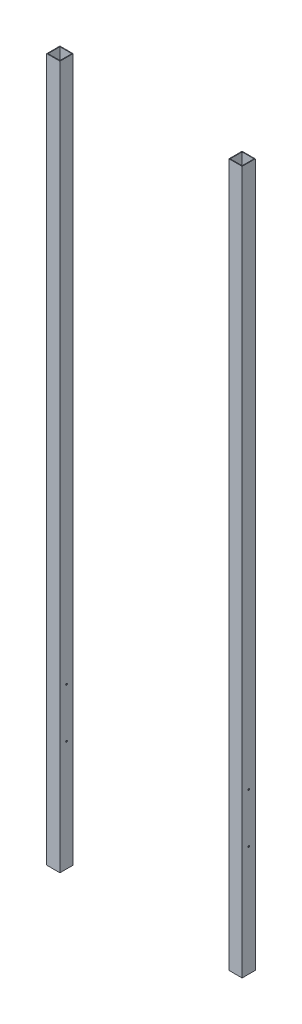
ISO-10303-21;
HEADER;
FILE_DESCRIPTION(('STEP AP214'),'2;1');
FILE_NAME('part.step','',(''),(''),'','','');
FILE_SCHEMA(('AUTOMOTIVE_DESIGN { 1 0 10303 214 1 1 1 1 }'));
ENDSEC;
DATA;
#1=APPLICATION_CONTEXT('core data for automotive mechanical design processes');
#2=APPLICATION_PROTOCOL_DEFINITION('international standard','automotive_design',2000,#1);
#3=PRODUCT_CONTEXT('',#1,'mechanical');
#4=PRODUCT('Part','Part','',(#3));
#5=PRODUCT_RELATED_PRODUCT_CATEGORY('part','',(#4));
#6=PRODUCT_DEFINITION_FORMATION('','',#4);
#7=PRODUCT_DEFINITION_CONTEXT('part definition',#1,'design');
#8=PRODUCT_DEFINITION('design','',#6,#7);
#9=PRODUCT_DEFINITION_SHAPE('','',#8);
#10=(LENGTH_UNIT() NAMED_UNIT(*) SI_UNIT(.MILLI.,.METRE.));
#11=(NAMED_UNIT(*) PLANE_ANGLE_UNIT() SI_UNIT($,.RADIAN.));
#12=(NAMED_UNIT(*) SI_UNIT($,.STERADIAN.) SOLID_ANGLE_UNIT());
#13=UNCERTAINTY_MEASURE_WITH_UNIT(LENGTH_MEASURE(1.E-05),#10,'distance_accuracy_value','');
#14=(GEOMETRIC_REPRESENTATION_CONTEXT(3) GLOBAL_UNCERTAINTY_ASSIGNED_CONTEXT((#13)) GLOBAL_UNIT_ASSIGNED_CONTEXT((#10,
#11,#12)) REPRESENTATION_CONTEXT('',''));
#15=CARTESIAN_POINT('',(0.,0.,0.));
#16=DIRECTION('',(0.,0.,1.));
#17=DIRECTION('',(1.,0.,0.));
#18=AXIS2_PLACEMENT_3D('',#15,#16,#17);
#19=CARTESIAN_POINT('',(0.,1898.65,0.));
#20=DIRECTION('',(0.,-1.,0.));
#21=DIRECTION('',(0.,0.,-1.));
#22=AXIS2_PLACEMENT_3D('',#19,#20,#21);
#23=PLANE('',#22);
#24=DIRECTION('',(0.,0.,-1.));
#25=VECTOR('',#24,1.);
#26=CARTESIAN_POINT('',(526.034,1898.65,1.651));
#27=LINE('',#26,#25);
#28=CARTESIAN_POINT('',(526.034,1898.65,1.651));
#29=VERTEX_POINT('',#28);
#30=CARTESIAN_POINT('',(526.034,1898.65,-33.909));
#31=VERTEX_POINT('',#30);
#32=EDGE_CURVE('E147',#29,#31,#27,.T.);
#33=ORIENTED_EDGE('',*,*,#32,.T.);
#34=DIRECTION('',(-1.,0.,0.));
#35=VECTOR('',#34,1.);
#36=CARTESIAN_POINT('',(490.474,1898.65,-33.909));
#37=LINE('',#36,#35);
#38=CARTESIAN_POINT('',(490.474,1898.65,-33.909));
#39=VERTEX_POINT('',#38);
#40=EDGE_CURVE('E150',#31,#39,#37,.T.);
#41=ORIENTED_EDGE('',*,*,#40,.T.);
#42=DIRECTION('',(0.,0.,1.));
#43=VECTOR('',#42,1.);
#44=CARTESIAN_POINT('',(490.474,1898.65,1.651));
#45=LINE('',#44,#43);
#46=CARTESIAN_POINT('',(490.474,1898.65,1.651));
#47=VERTEX_POINT('',#46);
#48=EDGE_CURVE('E153',#39,#47,#45,.T.);
#49=ORIENTED_EDGE('',*,*,#48,.T.);
#50=DIRECTION('',(1.,0.,0.));
#51=VECTOR('',#50,1.);
#52=CARTESIAN_POINT('',(490.474,1898.65,1.651));
#53=LINE('',#52,#51);
#54=EDGE_CURVE('E155',#47,#29,#53,.T.);
#55=ORIENTED_EDGE('',*,*,#54,.T.);
#56=EDGE_LOOP('',(#33,#41,#49,#55));
#57=FACE_BOUND('',#56,.T.);
#58=DIRECTION('',(0.,0.,-1.));
#59=VECTOR('',#58,1.);
#60=CARTESIAN_POINT('',(524.383,1898.65,0.));
#61=LINE('',#60,#59);
#62=CARTESIAN_POINT('',(524.383,1898.65,0.));
#63=VERTEX_POINT('',#62);
#64=CARTESIAN_POINT('',(524.383,1898.65,-32.258));
#65=VERTEX_POINT('',#64);
#66=EDGE_CURVE('E109',#63,#65,#61,.T.);
#67=ORIENTED_EDGE('',*,*,#66,.F.);
#68=DIRECTION('',(1.,0.,0.));
#69=VECTOR('',#68,1.);
#70=CARTESIAN_POINT('',(492.125,1898.65,0.));
#71=LINE('',#70,#69);
#72=CARTESIAN_POINT('',(492.125,1898.65,0.));
#73=VERTEX_POINT('',#72);
#74=EDGE_CURVE('E131',#73,#63,#71,.T.);
#75=ORIENTED_EDGE('',*,*,#74,.F.);
#76=DIRECTION('',(0.,0.,1.));
#77=VECTOR('',#76,1.);
#78=CARTESIAN_POINT('',(492.125,1898.65,0.));
#79=LINE('',#78,#77);
#80=CARTESIAN_POINT('',(492.125,1898.65,-32.258));
#81=VERTEX_POINT('',#80);
#82=EDGE_CURVE('E129',#81,#73,#79,.T.);
#83=ORIENTED_EDGE('',*,*,#82,.F.);
#84=DIRECTION('',(-1.,0.,0.));
#85=VECTOR('',#84,1.);
#86=CARTESIAN_POINT('',(492.125,1898.65,-32.258));
#87=LINE('',#86,#85);
#88=EDGE_CURVE('E117',#65,#81,#87,.T.);
#89=ORIENTED_EDGE('',*,*,#88,.F.);
#90=EDGE_LOOP('',(#67,#75,#83,#89));
#91=FACE_BOUND('',#90,.T.);
#92=ADVANCED_FACE('F42',(#57,#91),#23,.F.);
#93=CARTESIAN_POINT('',(0.,0.,0.));
#94=DIRECTION('',(0.,-1.,0.));
#95=DIRECTION('',(0.,0.,-1.));
#96=AXIS2_PLACEMENT_3D('',#93,#94,#95);
#97=PLANE('',#96);
#98=DIRECTION('',(0.,0.,-1.));
#99=VECTOR('',#98,1.);
#100=CARTESIAN_POINT('',(526.034,0.,1.651));
#101=LINE('',#100,#99);
#102=CARTESIAN_POINT('',(526.034,0.,1.651));
#103=VERTEX_POINT('',#102);
#104=CARTESIAN_POINT('',(526.034,0.,-33.909));
#105=VERTEX_POINT('',#104);
#106=EDGE_CURVE('E125',#103,#105,#101,.T.);
#107=ORIENTED_EDGE('',*,*,#106,.F.);
#108=DIRECTION('',(1.,0.,0.));
#109=VECTOR('',#108,1.);
#110=CARTESIAN_POINT('',(490.474,0.,1.651));
#111=LINE('',#110,#109);
#112=CARTESIAN_POINT('',(490.474,0.,1.651));
#113=VERTEX_POINT('',#112);
#114=EDGE_CURVE('E151',#113,#103,#111,.T.);
#115=ORIENTED_EDGE('',*,*,#114,.F.);
#116=DIRECTION('',(0.,0.,1.));
#117=VECTOR('',#116,1.);
#118=CARTESIAN_POINT('',(490.474,0.,1.651));
#119=LINE('',#118,#117);
#120=CARTESIAN_POINT('',(490.474,0.,-33.909));
#121=VERTEX_POINT('',#120);
#122=EDGE_CURVE('E162',#121,#113,#119,.T.);
#123=ORIENTED_EDGE('',*,*,#122,.F.);
#124=DIRECTION('',(-1.,0.,0.));
#125=VECTOR('',#124,1.);
#126=CARTESIAN_POINT('',(490.474,0.,-33.909));
#127=LINE('',#126,#125);
#128=EDGE_CURVE('E160',#105,#121,#127,.T.);
#129=ORIENTED_EDGE('',*,*,#128,.F.);
#130=EDGE_LOOP('',(#107,#115,#123,#129));
#131=FACE_BOUND('',#130,.T.);
#132=DIRECTION('',(1.,0.,0.));
#133=VECTOR('',#132,1.);
#134=CARTESIAN_POINT('',(492.125,0.,0.));
#135=LINE('',#134,#133);
#136=CARTESIAN_POINT('',(492.125,0.,0.));
#137=VERTEX_POINT('',#136);
#138=CARTESIAN_POINT('',(524.383,0.,0.));
#139=VERTEX_POINT('',#138);
#140=EDGE_CURVE('E118',#137,#139,#135,.T.);
#141=ORIENTED_EDGE('',*,*,#140,.T.);
#142=DIRECTION('',(0.,0.,-1.));
#143=VECTOR('',#142,1.);
#144=CARTESIAN_POINT('',(524.383,0.,0.));
#145=LINE('',#144,#143);
#146=CARTESIAN_POINT('',(524.383,0.,-32.258));
#147=VERTEX_POINT('',#146);
#148=EDGE_CURVE('E67',#139,#147,#145,.T.);
#149=ORIENTED_EDGE('',*,*,#148,.T.);
#150=DIRECTION('',(-1.,0.,0.));
#151=VECTOR('',#150,1.);
#152=CARTESIAN_POINT('',(492.125,0.,-32.258));
#153=LINE('',#152,#151);
#154=CARTESIAN_POINT('',(492.125,0.,-32.258));
#155=VERTEX_POINT('',#154);
#156=EDGE_CURVE('E124',#147,#155,#153,.T.);
#157=ORIENTED_EDGE('',*,*,#156,.T.);
#158=DIRECTION('',(0.,0.,1.));
#159=VECTOR('',#158,1.);
#160=CARTESIAN_POINT('',(492.125,0.,0.));
#161=LINE('',#160,#159);
#162=EDGE_CURVE('E139',#155,#137,#161,.T.);
#163=ORIENTED_EDGE('',*,*,#162,.T.);
#164=EDGE_LOOP('',(#141,#149,#157,#163));
#165=FACE_BOUND('',#164,.T.);
#166=ADVANCED_FACE('F210',(#131,#165),#97,.T.);
#167=CARTESIAN_POINT('',(526.034,1898.65,1.651));
#168=DIRECTION('',(-1.,0.,0.));
#169=DIRECTION('',(0.,0.,1.));
#170=AXIS2_PLACEMENT_3D('',#167,#168,#169);
#171=PLANE('',#170);
#172=CARTESIAN_POINT('',(526.034,431.8,-16.1290000000002));
#173=DIRECTION('',(1.,0.,0.));
#174=DIRECTION('',(0.,0.,-1.));
#175=AXIS2_PLACEMENT_3D('',#172,#173,#174);
#176=CIRCLE('',#175,2.15264999999998);
#177=CARTESIAN_POINT('',(526.034,431.8,-18.2816500000002));
#178=VERTEX_POINT('',#177);
#179=EDGE_CURVE('E271',#178,#178,#176,.T.);
#180=ORIENTED_EDGE('',*,*,#179,.F.);
#181=EDGE_LOOP('',(#180));
#182=FACE_BOUND('',#181,.T.);
#183=CARTESIAN_POINT('',(526.034,298.45,-16.1290000000002));
#184=DIRECTION('',(1.,0.,0.));
#185=DIRECTION('',(0.,0.,-1.));
#186=AXIS2_PLACEMENT_3D('',#183,#184,#185);
#187=CIRCLE('',#186,2.15264999999998);
#188=CARTESIAN_POINT('',(526.034,298.45,-18.2816500000002));
#189=VERTEX_POINT('',#188);
#190=EDGE_CURVE('E174',#189,#189,#187,.T.);
#191=ORIENTED_EDGE('',*,*,#190,.F.);
#192=EDGE_LOOP('',(#191));
#193=FACE_BOUND('',#192,.T.);
#194=ORIENTED_EDGE('',*,*,#106,.T.);
#195=DIRECTION('',(0.,-1.,0.));
#196=VECTOR('',#195,1.);
#197=CARTESIAN_POINT('',(526.034,1898.65,-33.909));
#198=LINE('',#197,#196);
#199=EDGE_CURVE('E12',#31,#105,#198,.T.);
#200=ORIENTED_EDGE('',*,*,#199,.F.);
#201=ORIENTED_EDGE('',*,*,#32,.F.);
#202=DIRECTION('',(0.,-1.,0.));
#203=VECTOR('',#202,1.);
#204=CARTESIAN_POINT('',(526.034,1898.65,1.651));
#205=LINE('',#204,#203);
#206=EDGE_CURVE('E157',#29,#103,#205,.T.);
#207=ORIENTED_EDGE('',*,*,#206,.T.);
#208=EDGE_LOOP('',(#194,#200,#201,#207));
#209=FACE_BOUND('',#208,.T.);
#210=ADVANCED_FACE('F44',(#182,#193,#209),#171,.F.);
#211=CARTESIAN_POINT('',(490.474,1898.65,-33.909));
#212=DIRECTION('',(0.,0.,1.));
#213=DIRECTION('',(1.,0.,0.));
#214=AXIS2_PLACEMENT_3D('',#211,#212,#213);
#215=PLANE('',#214);
#216=ORIENTED_EDGE('',*,*,#128,.T.);
#217=DIRECTION('',(0.,-1.,0.));
#218=VECTOR('',#217,1.);
#219=CARTESIAN_POINT('',(490.474,1898.65,-33.909));
#220=LINE('',#219,#218);
#221=EDGE_CURVE('E51',#39,#121,#220,.T.);
#222=ORIENTED_EDGE('',*,*,#221,.F.);
#223=ORIENTED_EDGE('',*,*,#40,.F.);
#224=ORIENTED_EDGE('',*,*,#199,.T.);
#225=EDGE_LOOP('',(#216,#222,#223,#224));
#226=FACE_BOUND('',#225,.T.);
#227=ADVANCED_FACE('F226',(#226),#215,.F.);
#228=CARTESIAN_POINT('',(490.474,1898.65,1.651));
#229=DIRECTION('',(1.,0.,0.));
#230=DIRECTION('',(0.,0.,-1.));
#231=AXIS2_PLACEMENT_3D('',#228,#229,#230);
#232=PLANE('',#231);
#233=CARTESIAN_POINT('',(490.474,431.8,-16.1290000000002));
#234=DIRECTION('',(1.,0.,0.));
#235=DIRECTION('',(0.,0.,-1.));
#236=AXIS2_PLACEMENT_3D('',#233,#234,#235);
#237=CIRCLE('',#236,2.15264999999992);
#238=CARTESIAN_POINT('',(490.474,431.8,-18.2816500000001));
#239=VERTEX_POINT('',#238);
#240=EDGE_CURVE('E185',#239,#239,#237,.T.);
#241=ORIENTED_EDGE('',*,*,#240,.T.);
#242=EDGE_LOOP('',(#241));
#243=FACE_BOUND('',#242,.T.);
#244=CARTESIAN_POINT('',(490.474,298.45,-16.1290000000002));
#245=DIRECTION('',(1.,0.,0.));
#246=DIRECTION('',(0.,0.,-1.));
#247=AXIS2_PLACEMENT_3D('',#244,#245,#246);
#248=CIRCLE('',#247,2.15264999999992);
#249=CARTESIAN_POINT('',(490.474,298.45,-18.2816500000001));
#250=VERTEX_POINT('',#249);
#251=EDGE_CURVE('E137',#250,#250,#248,.T.);
#252=ORIENTED_EDGE('',*,*,#251,.T.);
#253=EDGE_LOOP('',(#252));
#254=FACE_BOUND('',#253,.T.);
#255=ORIENTED_EDGE('',*,*,#122,.T.);
#256=DIRECTION('',(0.,-1.,0.));
#257=VECTOR('',#256,1.);
#258=CARTESIAN_POINT('',(490.474,1898.65,1.651));
#259=LINE('',#258,#257);
#260=EDGE_CURVE('E167',#47,#113,#259,.T.);
#261=ORIENTED_EDGE('',*,*,#260,.F.);
#262=ORIENTED_EDGE('',*,*,#48,.F.);
#263=ORIENTED_EDGE('',*,*,#221,.T.);
#264=EDGE_LOOP('',(#255,#261,#262,#263));
#265=FACE_BOUND('',#264,.T.);
#266=ADVANCED_FACE('F191',(#243,#254,#265),#232,.F.);
#267=CARTESIAN_POINT('',(490.474,1898.65,1.651));
#268=DIRECTION('',(0.,0.,-1.));
#269=DIRECTION('',(-1.,0.,0.));
#270=AXIS2_PLACEMENT_3D('',#267,#268,#269);
#271=PLANE('',#270);
#272=ORIENTED_EDGE('',*,*,#114,.T.);
#273=ORIENTED_EDGE('',*,*,#206,.F.);
#274=ORIENTED_EDGE('',*,*,#54,.F.);
#275=ORIENTED_EDGE('',*,*,#260,.T.);
#276=EDGE_LOOP('',(#272,#273,#274,#275));
#277=FACE_BOUND('',#276,.T.);
#278=ADVANCED_FACE('F221',(#277),#271,.F.);
#279=CARTESIAN_POINT('',(524.383,1898.65,0.));
#280=DIRECTION('',(-1.,0.,0.));
#281=DIRECTION('',(0.,0.,1.));
#282=AXIS2_PLACEMENT_3D('',#279,#280,#281);
#283=PLANE('',#282);
#284=CARTESIAN_POINT('',(524.383,431.8,-16.1290000000002));
#285=DIRECTION('',(-1.,0.,0.));
#286=DIRECTION('',(0.,0.,1.));
#287=AXIS2_PLACEMENT_3D('',#284,#285,#286);
#288=CIRCLE('',#287,2.15264999999992);
#289=CARTESIAN_POINT('',(524.383,431.8,-13.9763500000003));
#290=VERTEX_POINT('',#289);
#291=EDGE_CURVE('E180',#290,#290,#288,.T.);
#292=ORIENTED_EDGE('',*,*,#291,.F.);
#293=EDGE_LOOP('',(#292));
#294=FACE_BOUND('',#293,.T.);
#295=CARTESIAN_POINT('',(524.383,298.45,-16.1290000000002));
#296=DIRECTION('',(-1.,0.,0.));
#297=DIRECTION('',(0.,0.,1.));
#298=AXIS2_PLACEMENT_3D('',#295,#296,#297);
#299=CIRCLE('',#298,2.15264999999992);
#300=CARTESIAN_POINT('',(524.383,298.45,-13.9763500000003));
#301=VERTEX_POINT('',#300);
#302=EDGE_CURVE('E171',#301,#301,#299,.T.);
#303=ORIENTED_EDGE('',*,*,#302,.F.);
#304=EDGE_LOOP('',(#303));
#305=FACE_BOUND('',#304,.T.);
#306=ORIENTED_EDGE('',*,*,#148,.F.);
#307=DIRECTION('',(0.,-1.,0.));
#308=VECTOR('',#307,1.);
#309=CARTESIAN_POINT('',(524.383,1898.65,0.));
#310=LINE('',#309,#308);
#311=EDGE_CURVE('E113',#63,#139,#310,.T.);
#312=ORIENTED_EDGE('',*,*,#311,.F.);
#313=ORIENTED_EDGE('',*,*,#66,.T.);
#314=DIRECTION('',(0.,-1.,0.));
#315=VECTOR('',#314,1.);
#316=CARTESIAN_POINT('',(524.383,1898.65,-32.258));
#317=LINE('',#316,#315);
#318=EDGE_CURVE('E112',#65,#147,#317,.T.);
#319=ORIENTED_EDGE('',*,*,#318,.T.);
#320=EDGE_LOOP('',(#306,#312,#313,#319));
#321=FACE_BOUND('',#320,.T.);
#322=ADVANCED_FACE('F111',(#294,#305,#321),#283,.T.);
#323=CARTESIAN_POINT('',(492.125,1898.65,-32.258));
#324=DIRECTION('',(0.,0.,1.));
#325=DIRECTION('',(1.,0.,0.));
#326=AXIS2_PLACEMENT_3D('',#323,#324,#325);
#327=PLANE('',#326);
#328=ORIENTED_EDGE('',*,*,#156,.F.);
#329=ORIENTED_EDGE('',*,*,#318,.F.);
#330=ORIENTED_EDGE('',*,*,#88,.T.);
#331=DIRECTION('',(0.,-1.,0.));
#332=VECTOR('',#331,1.);
#333=CARTESIAN_POINT('',(492.125,1898.65,-32.258));
#334=LINE('',#333,#332);
#335=EDGE_CURVE('E126',#81,#155,#334,.T.);
#336=ORIENTED_EDGE('',*,*,#335,.T.);
#337=EDGE_LOOP('',(#328,#329,#330,#336));
#338=FACE_BOUND('',#337,.T.);
#339=ADVANCED_FACE('F121',(#338),#327,.T.);
#340=CARTESIAN_POINT('',(492.125,1898.65,0.));
#341=DIRECTION('',(1.,0.,0.));
#342=DIRECTION('',(0.,0.,-1.));
#343=AXIS2_PLACEMENT_3D('',#340,#341,#342);
#344=PLANE('',#343);
#345=CARTESIAN_POINT('',(492.125,431.8,-16.1290000000002));
#346=DIRECTION('',(1.,0.,0.));
#347=DIRECTION('',(0.,0.,-1.));
#348=AXIS2_PLACEMENT_3D('',#345,#346,#347);
#349=CIRCLE('',#348,2.15264999999992);
#350=CARTESIAN_POINT('',(492.125,431.8,-18.2816500000001));
#351=VERTEX_POINT('',#350);
#352=EDGE_CURVE('E46',#351,#351,#349,.T.);
#353=ORIENTED_EDGE('',*,*,#352,.F.);
#354=EDGE_LOOP('',(#353));
#355=FACE_BOUND('',#354,.T.);
#356=CARTESIAN_POINT('',(492.125,298.45,-16.1290000000002));
#357=DIRECTION('',(1.,0.,0.));
#358=DIRECTION('',(0.,0.,-1.));
#359=AXIS2_PLACEMENT_3D('',#356,#357,#358);
#360=CIRCLE('',#359,2.15264999999992);
#361=CARTESIAN_POINT('',(492.125,298.45,-18.2816500000001));
#362=VERTEX_POINT('',#361);
#363=EDGE_CURVE('E173',#362,#362,#360,.T.);
#364=ORIENTED_EDGE('',*,*,#363,.F.);
#365=EDGE_LOOP('',(#364));
#366=FACE_BOUND('',#365,.T.);
#367=ORIENTED_EDGE('',*,*,#162,.F.);
#368=ORIENTED_EDGE('',*,*,#335,.F.);
#369=ORIENTED_EDGE('',*,*,#82,.T.);
#370=DIRECTION('',(0.,-1.,0.));
#371=VECTOR('',#370,1.);
#372=CARTESIAN_POINT('',(492.125,1898.65,0.));
#373=LINE('',#372,#371);
#374=EDGE_CURVE('E59',#73,#137,#373,.T.);
#375=ORIENTED_EDGE('',*,*,#374,.T.);
#376=EDGE_LOOP('',(#367,#368,#369,#375));
#377=FACE_BOUND('',#376,.T.);
#378=ADVANCED_FACE('F250',(#355,#366,#377),#344,.T.);
#379=CARTESIAN_POINT('',(492.125,1898.65,0.));
#380=DIRECTION('',(0.,0.,-1.));
#381=DIRECTION('',(-1.,0.,0.));
#382=AXIS2_PLACEMENT_3D('',#379,#380,#381);
#383=PLANE('',#382);
#384=ORIENTED_EDGE('',*,*,#140,.F.);
#385=ORIENTED_EDGE('',*,*,#374,.F.);
#386=ORIENTED_EDGE('',*,*,#74,.T.);
#387=ORIENTED_EDGE('',*,*,#311,.T.);
#388=EDGE_LOOP('',(#384,#385,#386,#387));
#389=FACE_BOUND('',#388,.T.);
#390=ADVANCED_FACE('F207',(#389),#383,.T.);
#391=CARTESIAN_POINT('',(526.034,298.45,-16.1290000000002));
#392=DIRECTION('',(1.,0.,0.));
#393=DIRECTION('',(0.,0.,-1.));
#394=AXIS2_PLACEMENT_3D('',#391,#392,#393);
#395=CYLINDRICAL_SURFACE('',#394,2.15264999999992);
#396=ORIENTED_EDGE('',*,*,#302,.T.);
#397=EDGE_LOOP('',(#396));
#398=FACE_BOUND('',#397,.T.);
#399=ORIENTED_EDGE('',*,*,#190,.T.);
#400=EDGE_LOOP('',(#399));
#401=FACE_BOUND('',#400,.T.);
#402=ADVANCED_FACE('F197',(#398,#401),#395,.F.);
#403=ORIENTED_EDGE('',*,*,#363,.T.);
#404=EDGE_LOOP('',(#403));
#405=FACE_BOUND('',#404,.T.);
#406=ORIENTED_EDGE('',*,*,#251,.F.);
#407=EDGE_LOOP('',(#406));
#408=FACE_BOUND('',#407,.T.);
#409=ADVANCED_FACE('F194',(#405,#408),#395,.F.);
#410=CARTESIAN_POINT('',(526.034,431.8,-16.1290000000002));
#411=DIRECTION('',(1.,0.,0.));
#412=DIRECTION('',(0.,0.,-1.));
#413=AXIS2_PLACEMENT_3D('',#410,#411,#412);
#414=CYLINDRICAL_SURFACE('',#413,2.15264999999992);
#415=ORIENTED_EDGE('',*,*,#352,.T.);
#416=EDGE_LOOP('',(#415));
#417=FACE_BOUND('',#416,.T.);
#418=ORIENTED_EDGE('',*,*,#240,.F.);
#419=EDGE_LOOP('',(#418));
#420=FACE_BOUND('',#419,.T.);
#421=ADVANCED_FACE('F196',(#417,#420),#414,.F.);
#422=ORIENTED_EDGE('',*,*,#291,.T.);
#423=EDGE_LOOP('',(#422));
#424=FACE_BOUND('',#423,.T.);
#425=ORIENTED_EDGE('',*,*,#179,.T.);
#426=EDGE_LOOP('',(#425));
#427=FACE_BOUND('',#426,.T.);
#428=ADVANCED_FACE('F204',(#424,#427),#414,.F.);
#429=CLOSED_SHELL('',(#92,#166,#210,#227,#266,#278,#322,#339,#378,#390,#402,#409,#421,#428));
#430=MANIFOLD_SOLID_BREP('B2',#429);
#431=CARTESIAN_POINT('',(0.,1898.65,0.));
#432=DIRECTION('',(0.,1.,0.));
#433=DIRECTION('',(0.,0.,1.));
#434=AXIS2_PLACEMENT_3D('',#431,#432,#433);
#435=PLANE('',#434);
#436=DIRECTION('',(1.,0.,0.));
#437=VECTOR('',#436,1.);
#438=CARTESIAN_POINT('',(-1.651,1898.65,1.651));
#439=LINE('',#438,#437);
#440=CARTESIAN_POINT('',(-1.651,1898.65,1.651));
#441=VERTEX_POINT('',#440);
#442=CARTESIAN_POINT('',(33.909,1898.65,1.651));
#443=VERTEX_POINT('',#442);
#444=EDGE_CURVE('E457',#441,#443,#439,.T.);
#445=ORIENTED_EDGE('',*,*,#444,.T.);
#446=DIRECTION('',(0.,0.,-1.));
#447=VECTOR('',#446,1.);
#448=CARTESIAN_POINT('',(33.909,1898.65,1.651));
#449=LINE('',#448,#447);
#450=CARTESIAN_POINT('',(33.909,1898.65,-33.909));
#451=VERTEX_POINT('',#450);
#452=EDGE_CURVE('E460',#443,#451,#449,.T.);
#453=ORIENTED_EDGE('',*,*,#452,.T.);
#454=DIRECTION('',(-1.,0.,0.));
#455=VECTOR('',#454,1.);
#456=CARTESIAN_POINT('',(-1.651,1898.65,-33.909));
#457=LINE('',#456,#455);
#458=CARTESIAN_POINT('',(-1.651,1898.65,-33.909));
#459=VERTEX_POINT('',#458);
#460=EDGE_CURVE('E463',#451,#459,#457,.T.);
#461=ORIENTED_EDGE('',*,*,#460,.T.);
#462=DIRECTION('',(0.,0.,1.));
#463=VECTOR('',#462,1.);
#464=CARTESIAN_POINT('',(-1.651,1898.65,1.651));
#465=LINE('',#464,#463);
#466=EDGE_CURVE('E465',#459,#441,#465,.T.);
#467=ORIENTED_EDGE('',*,*,#466,.T.);
#468=EDGE_LOOP('',(#445,#453,#461,#467));
#469=FACE_BOUND('',#468,.T.);
#470=DIRECTION('',(1.,0.,0.));
#471=VECTOR('',#470,1.);
#472=CARTESIAN_POINT('',(0.,1898.65,0.));
#473=LINE('',#472,#471);
#474=CARTESIAN_POINT('',(0.,1898.65,0.));
#475=VERTEX_POINT('',#474);
#476=CARTESIAN_POINT('',(32.258,1898.65,0.));
#477=VERTEX_POINT('',#476);
#478=EDGE_CURVE('E427',#475,#477,#473,.T.);
#479=ORIENTED_EDGE('',*,*,#478,.F.);
#480=DIRECTION('',(0.,0.,1.));
#481=VECTOR('',#480,1.);
#482=CARTESIAN_POINT('',(0.,1898.65,0.));
#483=LINE('',#482,#481);
#484=CARTESIAN_POINT('',(0.,1898.65,-32.258));
#485=VERTEX_POINT('',#484);
#486=EDGE_CURVE('E419',#485,#475,#483,.T.);
#487=ORIENTED_EDGE('',*,*,#486,.F.);
#488=DIRECTION('',(-1.,0.,0.));
#489=VECTOR('',#488,1.);
#490=CARTESIAN_POINT('',(0.,1898.65,-32.258));
#491=LINE('',#490,#489);
#492=CARTESIAN_POINT('',(32.258,1898.65,-32.258));
#493=VERTEX_POINT('',#492);
#494=EDGE_CURVE('E441',#493,#485,#491,.T.);
#495=ORIENTED_EDGE('',*,*,#494,.F.);
#496=DIRECTION('',(0.,0.,-1.));
#497=VECTOR('',#496,1.);
#498=CARTESIAN_POINT('',(32.258,1898.65,0.));
#499=LINE('',#498,#497);
#500=EDGE_CURVE('E439',#477,#493,#499,.T.);
#501=ORIENTED_EDGE('',*,*,#500,.F.);
#502=EDGE_LOOP('',(#479,#487,#495,#501));
#503=FACE_BOUND('',#502,.T.);
#504=ADVANCED_FACE('F353',(#469,#503),#435,.T.);
#505=CARTESIAN_POINT('',(0.,0.,0.));
#506=DIRECTION('',(0.,1.,0.));
#507=DIRECTION('',(0.,0.,1.));
#508=AXIS2_PLACEMENT_3D('',#505,#506,#507);
#509=PLANE('',#508);
#510=DIRECTION('',(1.,0.,0.));
#511=VECTOR('',#510,1.);
#512=CARTESIAN_POINT('',(-1.651,0.,1.651));
#513=LINE('',#512,#511);
#514=CARTESIAN_POINT('',(-1.651,0.,1.651));
#515=VERTEX_POINT('',#514);
#516=CARTESIAN_POINT('',(33.909,0.,1.651));
#517=VERTEX_POINT('',#516);
#518=EDGE_CURVE('E435',#515,#517,#513,.T.);
#519=ORIENTED_EDGE('',*,*,#518,.F.);
#520=DIRECTION('',(0.,0.,1.));
#521=VECTOR('',#520,1.);
#522=CARTESIAN_POINT('',(-1.651,0.,1.651));
#523=LINE('',#522,#521);
#524=CARTESIAN_POINT('',(-1.651,0.,-33.909));
#525=VERTEX_POINT('',#524);
#526=EDGE_CURVE('E461',#525,#515,#523,.T.);
#527=ORIENTED_EDGE('',*,*,#526,.F.);
#528=DIRECTION('',(-1.,0.,0.));
#529=VECTOR('',#528,1.);
#530=CARTESIAN_POINT('',(-1.651,0.,-33.909));
#531=LINE('',#530,#529);
#532=CARTESIAN_POINT('',(33.909,0.,-33.909));
#533=VERTEX_POINT('',#532);
#534=EDGE_CURVE('E472',#533,#525,#531,.T.);
#535=ORIENTED_EDGE('',*,*,#534,.F.);
#536=DIRECTION('',(0.,0.,-1.));
#537=VECTOR('',#536,1.);
#538=CARTESIAN_POINT('',(33.909,0.,1.651));
#539=LINE('',#538,#537);
#540=EDGE_CURVE('E470',#517,#533,#539,.T.);
#541=ORIENTED_EDGE('',*,*,#540,.F.);
#542=EDGE_LOOP('',(#519,#527,#535,#541));
#543=FACE_BOUND('',#542,.T.);
#544=DIRECTION('',(0.,0.,1.));
#545=VECTOR('',#544,1.);
#546=CARTESIAN_POINT('',(0.,0.,0.));
#547=LINE('',#546,#545);
#548=CARTESIAN_POINT('',(0.,0.,-32.258));
#549=VERTEX_POINT('',#548);
#550=CARTESIAN_POINT('',(0.,0.,0.));
#551=VERTEX_POINT('',#550);
#552=EDGE_CURVE('E377',#549,#551,#547,.T.);
#553=ORIENTED_EDGE('',*,*,#552,.T.);
#554=DIRECTION('',(1.,0.,0.));
#555=VECTOR('',#554,1.);
#556=CARTESIAN_POINT('',(0.,0.,0.));
#557=LINE('',#556,#555);
#558=CARTESIAN_POINT('',(32.258,0.,0.));
#559=VERTEX_POINT('',#558);
#560=EDGE_CURVE('E434',#551,#559,#557,.T.);
#561=ORIENTED_EDGE('',*,*,#560,.T.);
#562=DIRECTION('',(0.,0.,-1.));
#563=VECTOR('',#562,1.);
#564=CARTESIAN_POINT('',(32.258,0.,0.));
#565=LINE('',#564,#563);
#566=CARTESIAN_POINT('',(32.258,0.,-32.258));
#567=VERTEX_POINT('',#566);
#568=EDGE_CURVE('E449',#559,#567,#565,.T.);
#569=ORIENTED_EDGE('',*,*,#568,.T.);
#570=DIRECTION('',(-1.,0.,0.));
#571=VECTOR('',#570,1.);
#572=CARTESIAN_POINT('',(0.,0.,-32.258));
#573=LINE('',#572,#571);
#574=EDGE_CURVE('E428',#567,#549,#573,.T.);
#575=ORIENTED_EDGE('',*,*,#574,.T.);
#576=EDGE_LOOP('',(#553,#561,#569,#575));
#577=FACE_BOUND('',#576,.T.);
#578=ADVANCED_FACE('F491',(#543,#577),#509,.F.);
#579=CARTESIAN_POINT('',(-1.651,1898.65,1.651));
#580=DIRECTION('',(0.,0.,-1.));
#581=DIRECTION('',(-1.,0.,0.));
#582=AXIS2_PLACEMENT_3D('',#579,#580,#581);
#583=PLANE('',#582);
#584=ORIENTED_EDGE('',*,*,#518,.T.);
#585=DIRECTION('',(0.,-1.,0.));
#586=VECTOR('',#585,1.);
#587=CARTESIAN_POINT('',(33.909,1898.65,1.651));
#588=LINE('',#587,#586);
#589=EDGE_CURVE('E40',#443,#517,#588,.T.);
#590=ORIENTED_EDGE('',*,*,#589,.F.);
#591=ORIENTED_EDGE('',*,*,#444,.F.);
#592=DIRECTION('',(0.,-1.,0.));
#593=VECTOR('',#592,1.);
#594=CARTESIAN_POINT('',(-1.651,1898.65,1.651));
#595=LINE('',#594,#593);
#596=EDGE_CURVE('E467',#441,#515,#595,.T.);
#597=ORIENTED_EDGE('',*,*,#596,.T.);
#598=EDGE_LOOP('',(#584,#590,#591,#597));
#599=FACE_BOUND('',#598,.T.);
#600=ADVANCED_FACE('F355',(#599),#583,.F.);
#601=CARTESIAN_POINT('',(33.909,1898.65,1.651));
#602=DIRECTION('',(-1.,0.,0.));
#603=DIRECTION('',(0.,0.,1.));
#604=AXIS2_PLACEMENT_3D('',#601,#602,#603);
#605=PLANE('',#604);
#606=CARTESIAN_POINT('',(33.909,431.8,-16.1290000000002));
#607=DIRECTION('',(-1.,0.,0.));
#608=DIRECTION('',(0.,0.,1.));
#609=AXIS2_PLACEMENT_3D('',#606,#607,#608);
#610=CIRCLE('',#609,2.15264999999992);
#611=CARTESIAN_POINT('',(33.909,431.8,-13.9763500000003));
#612=VERTEX_POINT('',#611);
#613=EDGE_CURVE('E536',#612,#612,#610,.T.);
#614=ORIENTED_EDGE('',*,*,#613,.T.);
#615=EDGE_LOOP('',(#614));
#616=FACE_BOUND('',#615,.T.);
#617=CARTESIAN_POINT('',(33.909,298.45,-16.1290000000002));
#618=DIRECTION('',(-1.,0.,0.));
#619=DIRECTION('',(0.,0.,1.));
#620=AXIS2_PLACEMENT_3D('',#617,#618,#619);
#621=CIRCLE('',#620,2.15264999999992);
#622=CARTESIAN_POINT('',(33.909,298.45,-13.9763500000003));
#623=VERTEX_POINT('',#622);
#624=EDGE_CURVE('E539',#623,#623,#621,.T.);
#625=ORIENTED_EDGE('',*,*,#624,.T.);
#626=EDGE_LOOP('',(#625));
#627=FACE_BOUND('',#626,.T.);
#628=ORIENTED_EDGE('',*,*,#540,.T.);
#629=DIRECTION('',(0.,-1.,0.));
#630=VECTOR('',#629,1.);
#631=CARTESIAN_POINT('',(33.909,1898.65,-33.909));
#632=LINE('',#631,#630);
#633=EDGE_CURVE('E362',#451,#533,#632,.T.);
#634=ORIENTED_EDGE('',*,*,#633,.F.);
#635=ORIENTED_EDGE('',*,*,#452,.F.);
#636=ORIENTED_EDGE('',*,*,#589,.T.);
#637=EDGE_LOOP('',(#628,#634,#635,#636));
#638=FACE_BOUND('',#637,.T.);
#639=ADVANCED_FACE('F501',(#616,#627,#638),#605,.F.);
#640=CARTESIAN_POINT('',(-1.651,1898.65,-33.909));
#641=DIRECTION('',(0.,0.,1.));
#642=DIRECTION('',(1.,0.,0.));
#643=AXIS2_PLACEMENT_3D('',#640,#641,#642);
#644=PLANE('',#643);
#645=ORIENTED_EDGE('',*,*,#534,.T.);
#646=DIRECTION('',(0.,-1.,0.));
#647=VECTOR('',#646,1.);
#648=CARTESIAN_POINT('',(-1.651,1898.65,-33.909));
#649=LINE('',#648,#647);
#650=EDGE_CURVE('E477',#459,#525,#649,.T.);
#651=ORIENTED_EDGE('',*,*,#650,.F.);
#652=ORIENTED_EDGE('',*,*,#460,.F.);
#653=ORIENTED_EDGE('',*,*,#633,.T.);
#654=EDGE_LOOP('',(#645,#651,#652,#653));
#655=FACE_BOUND('',#654,.T.);
#656=ADVANCED_FACE('F485',(#655),#644,.F.);
#657=CARTESIAN_POINT('',(-1.651,1898.65,1.651));
#658=DIRECTION('',(1.,0.,0.));
#659=DIRECTION('',(0.,0.,-1.));
#660=AXIS2_PLACEMENT_3D('',#657,#658,#659);
#661=PLANE('',#660);
#662=CARTESIAN_POINT('',(-1.65099999999996,431.8,-16.1290000000002));
#663=DIRECTION('',(1.,0.,0.));
#664=DIRECTION('',(0.,0.,-1.));
#665=AXIS2_PLACEMENT_3D('',#662,#663,#664);
#666=CIRCLE('',#665,2.15264999999987);
#667=CARTESIAN_POINT('',(-1.65099999999996,431.8,-18.2816500000001));
#668=VERTEX_POINT('',#667);
#669=EDGE_CURVE('E530',#668,#668,#666,.T.);
#670=ORIENTED_EDGE('',*,*,#669,.T.);
#671=EDGE_LOOP('',(#670));
#672=FACE_BOUND('',#671,.T.);
#673=CARTESIAN_POINT('',(-1.65099999999996,298.45,-16.1290000000002));
#674=DIRECTION('',(1.,0.,0.));
#675=DIRECTION('',(0.,0.,-1.));
#676=AXIS2_PLACEMENT_3D('',#673,#674,#675);
#677=CIRCLE('',#676,2.15264999999987);
#678=CARTESIAN_POINT('',(-1.65099999999996,298.45,-18.2816500000001));
#679=VERTEX_POINT('',#678);
#680=EDGE_CURVE('E533',#679,#679,#677,.T.);
#681=ORIENTED_EDGE('',*,*,#680,.T.);
#682=EDGE_LOOP('',(#681));
#683=FACE_BOUND('',#682,.T.);
#684=ORIENTED_EDGE('',*,*,#526,.T.);
#685=ORIENTED_EDGE('',*,*,#596,.F.);
#686=ORIENTED_EDGE('',*,*,#466,.F.);
#687=ORIENTED_EDGE('',*,*,#650,.T.);
#688=EDGE_LOOP('',(#684,#685,#686,#687));
#689=FACE_BOUND('',#688,.T.);
#690=ADVANCED_FACE('F495',(#672,#683,#689),#661,.F.);
#691=CARTESIAN_POINT('',(0.,1898.65,0.));
#692=DIRECTION('',(1.,0.,0.));
#693=DIRECTION('',(0.,0.,-1.));
#694=AXIS2_PLACEMENT_3D('',#691,#692,#693);
#695=PLANE('',#694);
#696=CARTESIAN_POINT('',(0.,431.8,-16.1290000000002));
#697=DIRECTION('',(1.,0.,0.));
#698=DIRECTION('',(0.,0.,-1.));
#699=AXIS2_PLACEMENT_3D('',#696,#697,#698);
#700=CIRCLE('',#699,2.15264999999992);
#701=CARTESIAN_POINT('',(0.,431.8,-18.2816500000001));
#702=VERTEX_POINT('',#701);
#703=EDGE_CURVE('E357',#702,#702,#700,.T.);
#704=ORIENTED_EDGE('',*,*,#703,.F.);
#705=EDGE_LOOP('',(#704));
#706=FACE_BOUND('',#705,.T.);
#707=CARTESIAN_POINT('',(0.,298.45,-16.1290000000002));
#708=DIRECTION('',(1.,0.,0.));
#709=DIRECTION('',(0.,0.,-1.));
#710=AXIS2_PLACEMENT_3D('',#707,#708,#709);
#711=CIRCLE('',#710,2.15264999999992);
#712=CARTESIAN_POINT('',(0.,298.45,-18.2816500000001));
#713=VERTEX_POINT('',#712);
#714=EDGE_CURVE('E447',#713,#713,#711,.T.);
#715=ORIENTED_EDGE('',*,*,#714,.F.);
#716=EDGE_LOOP('',(#715));
#717=FACE_BOUND('',#716,.T.);
#718=ORIENTED_EDGE('',*,*,#552,.F.);
#719=DIRECTION('',(0.,-1.,0.));
#720=VECTOR('',#719,1.);
#721=CARTESIAN_POINT('',(0.,1898.65,-32.258));
#722=LINE('',#721,#720);
#723=EDGE_CURVE('E423',#485,#549,#722,.T.);
#724=ORIENTED_EDGE('',*,*,#723,.F.);
#725=ORIENTED_EDGE('',*,*,#486,.T.);
#726=DIRECTION('',(0.,-1.,0.));
#727=VECTOR('',#726,1.);
#728=CARTESIAN_POINT('',(0.,1898.65,0.));
#729=LINE('',#728,#727);
#730=EDGE_CURVE('E422',#475,#551,#729,.T.);
#731=ORIENTED_EDGE('',*,*,#730,.T.);
#732=EDGE_LOOP('',(#718,#724,#725,#731));
#733=FACE_BOUND('',#732,.T.);
#734=ADVANCED_FACE('F421',(#706,#717,#733),#695,.T.);
#735=CARTESIAN_POINT('',(0.,1898.65,0.));
#736=DIRECTION('',(0.,0.,-1.));
#737=DIRECTION('',(-1.,0.,0.));
#738=AXIS2_PLACEMENT_3D('',#735,#736,#737);
#739=PLANE('',#738);
#740=ORIENTED_EDGE('',*,*,#560,.F.);
#741=ORIENTED_EDGE('',*,*,#730,.F.);
#742=ORIENTED_EDGE('',*,*,#478,.T.);
#743=DIRECTION('',(0.,-1.,0.));
#744=VECTOR('',#743,1.);
#745=CARTESIAN_POINT('',(32.258,1898.65,0.));
#746=LINE('',#745,#744);
#747=EDGE_CURVE('E436',#477,#559,#746,.T.);
#748=ORIENTED_EDGE('',*,*,#747,.T.);
#749=EDGE_LOOP('',(#740,#741,#742,#748));
#750=FACE_BOUND('',#749,.T.);
#751=ADVANCED_FACE('F431',(#750),#739,.T.);
#752=CARTESIAN_POINT('',(32.258,1898.65,0.));
#753=DIRECTION('',(-1.,0.,0.));
#754=DIRECTION('',(0.,0.,1.));
#755=AXIS2_PLACEMENT_3D('',#752,#753,#754);
#756=PLANE('',#755);
#757=CARTESIAN_POINT('',(32.258,431.8,-16.1290000000002));
#758=DIRECTION('',(-1.,0.,0.));
#759=DIRECTION('',(0.,0.,1.));
#760=AXIS2_PLACEMENT_3D('',#757,#758,#759);
#761=CIRCLE('',#760,2.15264999999992);
#762=CARTESIAN_POINT('',(32.258,431.8,-13.9763500000003));
#763=VERTEX_POINT('',#762);
#764=EDGE_CURVE('E541',#763,#763,#761,.T.);
#765=ORIENTED_EDGE('',*,*,#764,.F.);
#766=EDGE_LOOP('',(#765));
#767=FACE_BOUND('',#766,.T.);
#768=CARTESIAN_POINT('',(32.258,298.45,-16.1290000000002));
#769=DIRECTION('',(-1.,0.,0.));
#770=DIRECTION('',(0.,0.,1.));
#771=AXIS2_PLACEMENT_3D('',#768,#769,#770);
#772=CIRCLE('',#771,2.15264999999992);
#773=CARTESIAN_POINT('',(32.258,298.45,-13.9763500000003));
#774=VERTEX_POINT('',#773);
#775=EDGE_CURVE('E535',#774,#774,#772,.T.);
#776=ORIENTED_EDGE('',*,*,#775,.F.);
#777=EDGE_LOOP('',(#776));
#778=FACE_BOUND('',#777,.T.);
#779=ORIENTED_EDGE('',*,*,#568,.F.);
#780=ORIENTED_EDGE('',*,*,#747,.F.);
#781=ORIENTED_EDGE('',*,*,#500,.T.);
#782=DIRECTION('',(0.,-1.,0.));
#783=VECTOR('',#782,1.);
#784=CARTESIAN_POINT('',(32.258,1898.65,-32.258));
#785=LINE('',#784,#783);
#786=EDGE_CURVE('E369',#493,#567,#785,.T.);
#787=ORIENTED_EDGE('',*,*,#786,.T.);
#788=EDGE_LOOP('',(#779,#780,#781,#787));
#789=FACE_BOUND('',#788,.T.);
#790=ADVANCED_FACE('F561',(#767,#778,#789),#756,.T.);
#791=CARTESIAN_POINT('',(0.,1898.65,-32.258));
#792=DIRECTION('',(0.,0.,1.));
#793=DIRECTION('',(1.,0.,0.));
#794=AXIS2_PLACEMENT_3D('',#791,#792,#793);
#795=PLANE('',#794);
#796=ORIENTED_EDGE('',*,*,#574,.F.);
#797=ORIENTED_EDGE('',*,*,#786,.F.);
#798=ORIENTED_EDGE('',*,*,#494,.T.);
#799=ORIENTED_EDGE('',*,*,#723,.T.);
#800=EDGE_LOOP('',(#796,#797,#798,#799));
#801=FACE_BOUND('',#800,.T.);
#802=ADVANCED_FACE('F553',(#801),#795,.T.);
#803=CARTESIAN_POINT('',(526.034,298.45,-16.1290000000002));
#804=DIRECTION('',(1.,0.,0.));
#805=DIRECTION('',(0.,0.,-1.));
#806=AXIS2_PLACEMENT_3D('',#803,#804,#805);
#807=CYLINDRICAL_SURFACE('',#806,2.15264999999992);
#808=ORIENTED_EDGE('',*,*,#714,.T.);
#809=EDGE_LOOP('',(#808));
#810=FACE_BOUND('',#809,.T.);
#811=ORIENTED_EDGE('',*,*,#680,.F.);
#812=EDGE_LOOP('',(#811));
#813=FACE_BOUND('',#812,.T.);
#814=ADVANCED_FACE('F549',(#810,#813),#807,.F.);
#815=ORIENTED_EDGE('',*,*,#775,.T.);
#816=EDGE_LOOP('',(#815));
#817=FACE_BOUND('',#816,.T.);
#818=ORIENTED_EDGE('',*,*,#624,.F.);
#819=EDGE_LOOP('',(#818));
#820=FACE_BOUND('',#819,.T.);
#821=ADVANCED_FACE('F552',(#817,#820),#807,.F.);
#822=CARTESIAN_POINT('',(526.034,431.8,-16.1290000000002));
#823=DIRECTION('',(1.,0.,0.));
#824=DIRECTION('',(0.,0.,-1.));
#825=AXIS2_PLACEMENT_3D('',#822,#823,#824);
#826=CYLINDRICAL_SURFACE('',#825,2.15264999999992);
#827=ORIENTED_EDGE('',*,*,#703,.T.);
#828=EDGE_LOOP('',(#827));
#829=FACE_BOUND('',#828,.T.);
#830=ORIENTED_EDGE('',*,*,#669,.F.);
#831=EDGE_LOOP('',(#830));
#832=FACE_BOUND('',#831,.T.);
#833=ADVANCED_FACE('F559',(#829,#832),#826,.F.);
#834=ORIENTED_EDGE('',*,*,#764,.T.);
#835=EDGE_LOOP('',(#834));
#836=FACE_BOUND('',#835,.T.);
#837=ORIENTED_EDGE('',*,*,#613,.F.);
#838=EDGE_LOOP('',(#837));
#839=FACE_BOUND('',#838,.T.);
#840=ADVANCED_FACE('F602',(#836,#839),#826,.F.);
#841=CLOSED_SHELL('',(#504,#578,#600,#639,#656,#690,#734,#751,#790,#802,#814,#821,#833,#840));
#842=MANIFOLD_SOLID_BREP('B6',#841);
#843=ADVANCED_BREP_SHAPE_REPRESENTATION('',(#18,#430,#842),#14);
#844=SHAPE_DEFINITION_REPRESENTATION(#9,#843);
ENDSEC;
END-ISO-10303-21;
